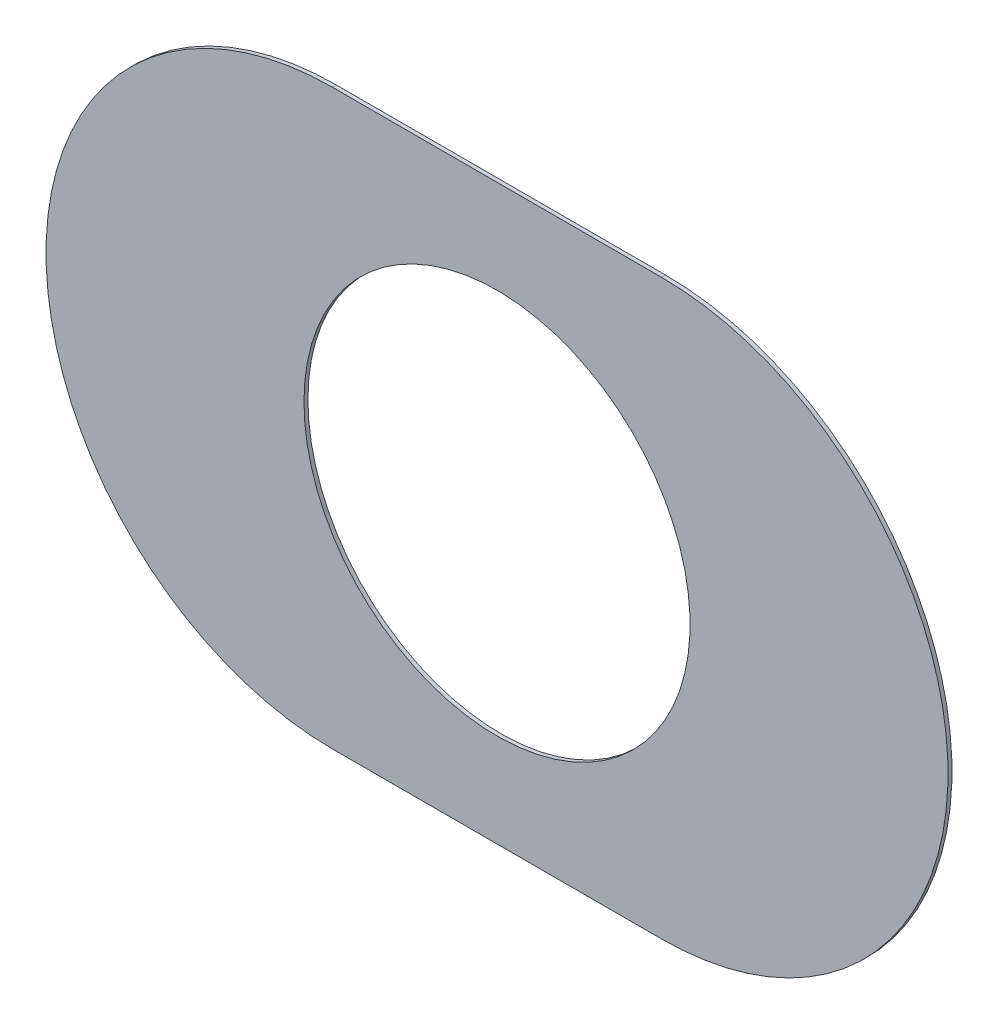
ISO-10303-21;
HEADER;
FILE_DESCRIPTION(('STEP AP214'),'2;1');
FILE_NAME('part.step','',(''),(''),'','','');
FILE_SCHEMA(('AUTOMOTIVE_DESIGN { 1 0 10303 214 1 1 1 1 }'));
ENDSEC;
DATA;
#1=APPLICATION_CONTEXT('core data for automotive mechanical design processes');
#2=APPLICATION_PROTOCOL_DEFINITION('international standard','automotive_design',2000,#1);
#3=PRODUCT_CONTEXT('',#1,'mechanical');
#4=PRODUCT('Part','Part','',(#3));
#5=PRODUCT_RELATED_PRODUCT_CATEGORY('part','',(#4));
#6=PRODUCT_DEFINITION_FORMATION('','',#4);
#7=PRODUCT_DEFINITION_CONTEXT('part definition',#1,'design');
#8=PRODUCT_DEFINITION('design','',#6,#7);
#9=PRODUCT_DEFINITION_SHAPE('','',#8);
#10=(LENGTH_UNIT() NAMED_UNIT(*) SI_UNIT(.MILLI.,.METRE.));
#11=(NAMED_UNIT(*) PLANE_ANGLE_UNIT() SI_UNIT($,.RADIAN.));
#12=(NAMED_UNIT(*) SI_UNIT($,.STERADIAN.) SOLID_ANGLE_UNIT());
#13=UNCERTAINTY_MEASURE_WITH_UNIT(LENGTH_MEASURE(1.E-05),#10,'distance_accuracy_value','');
#14=(GEOMETRIC_REPRESENTATION_CONTEXT(3) GLOBAL_UNCERTAINTY_ASSIGNED_CONTEXT((#13)) GLOBAL_UNIT_ASSIGNED_CONTEXT((#10,
#11,#12)) REPRESENTATION_CONTEXT('',''));
#15=CARTESIAN_POINT('',(0.,0.,0.));
#16=DIRECTION('',(0.,0.,1.));
#17=DIRECTION('',(1.,0.,0.));
#18=AXIS2_PLACEMENT_3D('',#15,#16,#17);
#19=CARTESIAN_POINT('',(1.54999965727325,42.4800006854535,0.));
#20=DIRECTION('',(0.,0.,-1.));
#21=DIRECTION('',(0.,-1.,0.));
#22=AXIS2_PLACEMENT_3D('',#19,#20,#21);
#23=PLANE('',#22);
#24=CARTESIAN_POINT('',(1.54999965727325,42.4800006854535,0.));
#25=DIRECTION('',(0.,0.,1.));
#26=DIRECTION('',(1.,0.,0.));
#27=AXIS2_PLACEMENT_3D('',#24,#25,#26);
#28=CIRCLE('',#27,0.49);
#29=CARTESIAN_POINT('',(1.05999965727325,42.4800006854535,0.));
#30=VERTEX_POINT('',#29);
#31=EDGE_CURVE('E127',#30,#30,#28,.T.);
#32=ORIENTED_EDGE('',*,*,#31,.F.);
#33=EDGE_LOOP('',(#32));
#34=FACE_BOUND('',#33,.T.);
#35=CARTESIAN_POINT('',(1.96740611181985,42.4800006854535,0.));
#36=DIRECTION('',(0.,0.,-1.));
#37=DIRECTION('',(0.,1.,0.));
#38=AXIS2_PLACEMENT_3D('',#35,#36,#37);
#39=CIRCLE('',#38,0.727257121659981);
#40=CARTESIAN_POINT('',(1.96740611181985,43.2072578071135,0.));
#41=VERTEX_POINT('',#40);
#42=CARTESIAN_POINT('',(1.96740611181985,41.7527435637935,0.));
#43=VERTEX_POINT('',#42);
#44=EDGE_CURVE('E28',#41,#43,#39,.T.);
#45=ORIENTED_EDGE('',*,*,#44,.F.);
#46=DIRECTION('',(1.,0.,0.));
#47=VECTOR('',#46,1.);
#48=CARTESIAN_POINT('',(1.13259320272665,43.2072578071135,0.));
#49=LINE('',#48,#47);
#50=CARTESIAN_POINT('',(1.13259320272665,43.2072578071135,0.));
#51=VERTEX_POINT('',#50);
#52=EDGE_CURVE('E111',#51,#41,#49,.T.);
#53=ORIENTED_EDGE('',*,*,#52,.F.);
#54=CARTESIAN_POINT('',(1.13259320272665,42.4800006854535,0.));
#55=DIRECTION('',(0.,0.,-1.));
#56=DIRECTION('',(0.,-1.,0.));
#57=AXIS2_PLACEMENT_3D('',#54,#55,#56);
#58=CIRCLE('',#57,0.727257121659981);
#59=CARTESIAN_POINT('',(1.13259320272665,41.7527435637935,0.));
#60=VERTEX_POINT('',#59);
#61=EDGE_CURVE('E92',#60,#51,#58,.T.);
#62=ORIENTED_EDGE('',*,*,#61,.F.);
#63=DIRECTION('',(-1.,0.,0.));
#64=VECTOR('',#63,1.);
#65=CARTESIAN_POINT('',(1.96740611181985,41.7527435637935,0.));
#66=LINE('',#65,#64);
#67=EDGE_CURVE('E75',#43,#60,#66,.T.);
#68=ORIENTED_EDGE('',*,*,#67,.F.);
#69=EDGE_LOOP('',(#45,#53,#62,#68));
#70=FACE_BOUND('',#69,.T.);
#71=ADVANCED_FACE('F17',(#34,#70),#23,.F.);
#72=CARTESIAN_POINT('',(1.54999965727325,42.4800006854535,-0.01));
#73=DIRECTION('',(0.,0.,-1.));
#74=DIRECTION('',(0.,-1.,0.));
#75=AXIS2_PLACEMENT_3D('',#72,#73,#74);
#76=PLANE('',#75);
#77=CARTESIAN_POINT('',(1.54999965727325,42.4800006854535,-0.01));
#78=DIRECTION('',(0.,0.,1.));
#79=DIRECTION('',(1.,0.,0.));
#80=AXIS2_PLACEMENT_3D('',#77,#78,#79);
#81=CIRCLE('',#80,0.49);
#82=CARTESIAN_POINT('',(1.05999965727325,42.4800006854535,-0.01));
#83=VERTEX_POINT('',#82);
#84=EDGE_CURVE('E135',#83,#83,#81,.T.);
#85=ORIENTED_EDGE('',*,*,#84,.T.);
#86=EDGE_LOOP('',(#85));
#87=FACE_BOUND('',#86,.T.);
#88=CARTESIAN_POINT('',(1.96740611181985,42.4800006854535,-0.01));
#89=DIRECTION('',(0.,0.,-1.));
#90=DIRECTION('',(0.,1.,0.));
#91=AXIS2_PLACEMENT_3D('',#88,#89,#90);
#92=CIRCLE('',#91,0.727257121659981);
#93=CARTESIAN_POINT('',(1.96740611181985,43.2072578071135,-0.01));
#94=VERTEX_POINT('',#93);
#95=CARTESIAN_POINT('',(1.96740611181985,41.7527435637935,-0.01));
#96=VERTEX_POINT('',#95);
#97=EDGE_CURVE('E11',#94,#96,#92,.T.);
#98=ORIENTED_EDGE('',*,*,#97,.T.);
#99=DIRECTION('',(-1.,0.,0.));
#100=VECTOR('',#99,1.);
#101=CARTESIAN_POINT('',(1.96740611181985,41.7527435637935,-0.01));
#102=LINE('',#101,#100);
#103=CARTESIAN_POINT('',(1.13259320272665,41.7527435637935,-0.01));
#104=VERTEX_POINT('',#103);
#105=EDGE_CURVE('E88',#96,#104,#102,.T.);
#106=ORIENTED_EDGE('',*,*,#105,.T.);
#107=CARTESIAN_POINT('',(1.13259320272665,42.4800006854535,-0.01));
#108=DIRECTION('',(0.,0.,-1.));
#109=DIRECTION('',(0.,-1.,0.));
#110=AXIS2_PLACEMENT_3D('',#107,#108,#109);
#111=CIRCLE('',#110,0.727257121659981);
#112=CARTESIAN_POINT('',(1.13259320272665,43.2072578071135,-0.01));
#113=VERTEX_POINT('',#112);
#114=EDGE_CURVE('E81',#104,#113,#111,.T.);
#115=ORIENTED_EDGE('',*,*,#114,.T.);
#116=DIRECTION('',(1.,0.,0.));
#117=VECTOR('',#116,1.);
#118=CARTESIAN_POINT('',(1.13259320272665,43.2072578071135,-0.01));
#119=LINE('',#118,#117);
#120=EDGE_CURVE('E85',#113,#94,#119,.T.);
#121=ORIENTED_EDGE('',*,*,#120,.T.);
#122=EDGE_LOOP('',(#98,#106,#115,#121));
#123=FACE_BOUND('',#122,.T.);
#124=ADVANCED_FACE('F83',(#87,#123),#76,.T.);
#125=CARTESIAN_POINT('',(1.96740611181985,42.4800006854535,0.));
#126=DIRECTION('',(0.,0.,-1.));
#127=DIRECTION('',(0.,1.,0.));
#128=AXIS2_PLACEMENT_3D('',#125,#126,#127);
#129=CYLINDRICAL_SURFACE('',#128,0.727257121659981);
#130=ORIENTED_EDGE('',*,*,#44,.T.);
#131=DIRECTION('',(0.,0.,-1.));
#132=VECTOR('',#131,1.);
#133=CARTESIAN_POINT('',(1.96740611181985,41.7527435637935,0.));
#134=LINE('',#133,#132);
#135=EDGE_CURVE('E117',#43,#96,#134,.T.);
#136=ORIENTED_EDGE('',*,*,#135,.T.);
#137=ORIENTED_EDGE('',*,*,#97,.F.);
#138=DIRECTION('',(0.,0.,-1.));
#139=VECTOR('',#138,1.);
#140=CARTESIAN_POINT('',(1.96740611181985,43.2072578071135,0.));
#141=LINE('',#140,#139);
#142=EDGE_CURVE('E104',#41,#94,#141,.T.);
#143=ORIENTED_EDGE('',*,*,#142,.F.);
#144=EDGE_LOOP('',(#130,#136,#137,#143));
#145=FACE_BOUND('',#144,.T.);
#146=ADVANCED_FACE('F154',(#145),#129,.T.);
#147=CARTESIAN_POINT('',(1.96740611181985,41.7527435637935,0.));
#148=DIRECTION('',(0.,-1.,0.));
#149=DIRECTION('',(0.,0.,-1.));
#150=AXIS2_PLACEMENT_3D('',#147,#148,#149);
#151=PLANE('',#150);
#152=ORIENTED_EDGE('',*,*,#67,.T.);
#153=DIRECTION('',(0.,0.,-1.));
#154=VECTOR('',#153,1.);
#155=CARTESIAN_POINT('',(1.13259320272665,41.7527435637935,0.));
#156=LINE('',#155,#154);
#157=EDGE_CURVE('E91',#60,#104,#156,.T.);
#158=ORIENTED_EDGE('',*,*,#157,.T.);
#159=ORIENTED_EDGE('',*,*,#105,.F.);
#160=ORIENTED_EDGE('',*,*,#135,.F.);
#161=EDGE_LOOP('',(#152,#158,#159,#160));
#162=FACE_BOUND('',#161,.T.);
#163=ADVANCED_FACE('F150',(#162),#151,.T.);
#164=CARTESIAN_POINT('',(1.13259320272665,42.4800006854535,0.));
#165=DIRECTION('',(0.,0.,-1.));
#166=DIRECTION('',(0.,-1.,0.));
#167=AXIS2_PLACEMENT_3D('',#164,#165,#166);
#168=CYLINDRICAL_SURFACE('',#167,0.727257121659981);
#169=ORIENTED_EDGE('',*,*,#61,.T.);
#170=DIRECTION('',(0.,0.,-1.));
#171=VECTOR('',#170,1.);
#172=CARTESIAN_POINT('',(1.13259320272665,43.2072578071135,0.));
#173=LINE('',#172,#171);
#174=EDGE_CURVE('E94',#51,#113,#173,.T.);
#175=ORIENTED_EDGE('',*,*,#174,.T.);
#176=ORIENTED_EDGE('',*,*,#114,.F.);
#177=ORIENTED_EDGE('',*,*,#157,.F.);
#178=EDGE_LOOP('',(#169,#175,#176,#177));
#179=FACE_BOUND('',#178,.T.);
#180=ADVANCED_FACE('F95',(#179),#168,.T.);
#181=CARTESIAN_POINT('',(1.13259320272665,43.2072578071135,0.));
#182=DIRECTION('',(0.,1.,0.));
#183=DIRECTION('',(1.,0.,0.));
#184=AXIS2_PLACEMENT_3D('',#181,#182,#183);
#185=PLANE('',#184);
#186=ORIENTED_EDGE('',*,*,#52,.T.);
#187=ORIENTED_EDGE('',*,*,#142,.T.);
#188=ORIENTED_EDGE('',*,*,#120,.F.);
#189=ORIENTED_EDGE('',*,*,#174,.F.);
#190=EDGE_LOOP('',(#186,#187,#188,#189));
#191=FACE_BOUND('',#190,.T.);
#192=ADVANCED_FACE('F102',(#191),#185,.T.);
#193=CARTESIAN_POINT('',(1.54999965727325,42.4800006854535,0.));
#194=DIRECTION('',(0.,0.,-1.));
#195=DIRECTION('',(1.,0.,0.));
#196=AXIS2_PLACEMENT_3D('',#193,#194,#195);
#197=CYLINDRICAL_SURFACE('',#196,0.49);
#198=ORIENTED_EDGE('',*,*,#84,.F.);
#199=DIRECTION('',(0.,0.,1.));
#200=VECTOR('',#199,1.);
#201=CARTESIAN_POINT('',(1.05999965727325,42.4800006854535,0.));
#202=LINE('',#201,#200);
#203=EDGE_CURVE('E21',#83,#30,#202,.T.);
#204=ORIENTED_EDGE('',*,*,#203,.T.);
#205=ORIENTED_EDGE('',*,*,#31,.T.);
#206=ORIENTED_EDGE('',*,*,#203,.F.);
#207=EDGE_LOOP('',(#198,#204,#205,#206));
#208=FACE_BOUND('',#207,.T.);
#209=ADVANCED_FACE('F19',(#208),#197,.F.);
#210=CLOSED_SHELL('',(#71,#124,#146,#163,#180,#192,#209));
#211=MANIFOLD_SOLID_BREP('B1',#210);
#212=ADVANCED_BREP_SHAPE_REPRESENTATION('',(#18,#211),#14);
#213=SHAPE_DEFINITION_REPRESENTATION(#9,#212);
ENDSEC;
END-ISO-10303-21;
